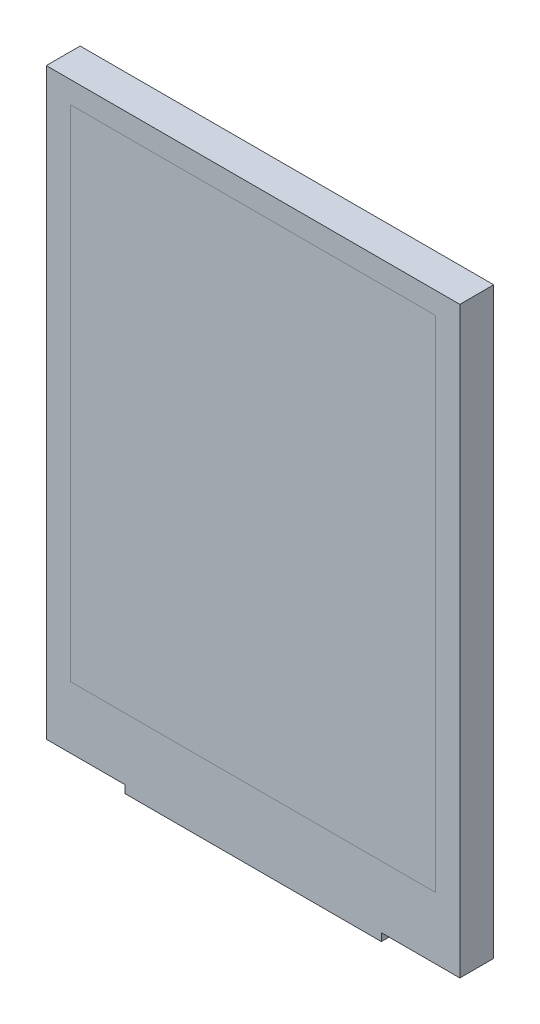
ISO-10303-21;
HEADER;
FILE_DESCRIPTION(('STEP AP214'),'2;1');
FILE_NAME('part.step','',(''),(''),'','','');
FILE_SCHEMA(('AUTOMOTIVE_DESIGN { 1 0 10303 214 1 1 1 1 }'));
ENDSEC;
DATA;
#1=APPLICATION_CONTEXT('core data for automotive mechanical design processes');
#2=APPLICATION_PROTOCOL_DEFINITION('international standard','automotive_design',2000,#1);
#3=PRODUCT_CONTEXT('',#1,'mechanical');
#4=PRODUCT('Part','Part','',(#3));
#5=PRODUCT_RELATED_PRODUCT_CATEGORY('part','',(#4));
#6=PRODUCT_DEFINITION_FORMATION('','',#4);
#7=PRODUCT_DEFINITION_CONTEXT('part definition',#1,'design');
#8=PRODUCT_DEFINITION('design','',#6,#7);
#9=PRODUCT_DEFINITION_SHAPE('','',#8);
#10=(LENGTH_UNIT() NAMED_UNIT(*) SI_UNIT(.MILLI.,.METRE.));
#11=(NAMED_UNIT(*) PLANE_ANGLE_UNIT() SI_UNIT($,.RADIAN.));
#12=(NAMED_UNIT(*) SI_UNIT($,.STERADIAN.) SOLID_ANGLE_UNIT());
#13=UNCERTAINTY_MEASURE_WITH_UNIT(LENGTH_MEASURE(1.E-05),#10,'distance_accuracy_value','');
#14=(GEOMETRIC_REPRESENTATION_CONTEXT(3) GLOBAL_UNCERTAINTY_ASSIGNED_CONTEXT((#13)) GLOBAL_UNIT_ASSIGNED_CONTEXT((#10,
#11,#12)) REPRESENTATION_CONTEXT('',''));
#15=CARTESIAN_POINT('',(0.,0.,0.));
#16=DIRECTION('',(0.,0.,1.));
#17=DIRECTION('',(1.,0.,0.));
#18=AXIS2_PLACEMENT_3D('',#15,#16,#17);
#19=CARTESIAN_POINT('',(0.,25.805,3.5));
#20=DIRECTION('',(0.,-1.,0.));
#21=DIRECTION('',(1.,0.,0.));
#22=AXIS2_PLACEMENT_3D('',#19,#20,#21);
#23=PLANE('',#22);
#24=DIRECTION('',(-1.,0.,0.));
#25=VECTOR('',#24,1.);
#26=CARTESIAN_POINT('',(0.,25.805,0.));
#27=LINE('',#26,#25);
#28=CARTESIAN_POINT('',(18.86,25.805,0.));
#29=VERTEX_POINT('',#28);
#30=CARTESIAN_POINT('',(-18.86,25.805,0.));
#31=VERTEX_POINT('',#30);
#32=EDGE_CURVE('E112',#29,#31,#27,.T.);
#33=ORIENTED_EDGE('',*,*,#32,.T.);
#34=DIRECTION('',(0.,0.,-1.));
#35=VECTOR('',#34,1.);
#36=CARTESIAN_POINT('',(-18.86,25.805,3.5));
#37=LINE('',#36,#35);
#38=CARTESIAN_POINT('',(-18.86,25.805,3.5));
#39=VERTEX_POINT('',#38);
#40=EDGE_CURVE('E12',#39,#31,#37,.T.);
#41=ORIENTED_EDGE('',*,*,#40,.F.);
#42=DIRECTION('',(-1.,0.,0.));
#43=VECTOR('',#42,1.);
#44=CARTESIAN_POINT('',(0.,25.805,3.5));
#45=LINE('',#44,#43);
#46=CARTESIAN_POINT('',(18.86,25.805,3.5));
#47=VERTEX_POINT('',#46);
#48=EDGE_CURVE('E98',#47,#39,#45,.T.);
#49=ORIENTED_EDGE('',*,*,#48,.F.);
#50=DIRECTION('',(0.,0.,-1.));
#51=VECTOR('',#50,1.);
#52=CARTESIAN_POINT('',(18.86,25.805,3.5));
#53=LINE('',#52,#51);
#54=EDGE_CURVE('E65',#47,#29,#53,.T.);
#55=ORIENTED_EDGE('',*,*,#54,.T.);
#56=EDGE_LOOP('',(#33,#41,#49,#55));
#57=FACE_BOUND('',#56,.T.);
#58=ADVANCED_FACE('F49',(#57),#23,.F.);
#59=CARTESIAN_POINT('',(-18.86,0.,3.5));
#60=DIRECTION('',(1.,0.,0.));
#61=DIRECTION('',(0.,0.,-1.));
#62=AXIS2_PLACEMENT_3D('',#59,#60,#61);
#63=PLANE('',#62);
#64=DIRECTION('',(0.,-1.,0.));
#65=VECTOR('',#64,1.);
#66=CARTESIAN_POINT('',(-18.86,0.,0.));
#67=LINE('',#66,#65);
#68=CARTESIAN_POINT('',(-18.86,-25.805,0.));
#69=VERTEX_POINT('',#68);
#70=EDGE_CURVE('E103',#31,#69,#67,.T.);
#71=ORIENTED_EDGE('',*,*,#70,.T.);
#72=DIRECTION('',(0.,0.,-1.));
#73=VECTOR('',#72,1.);
#74=CARTESIAN_POINT('',(-18.86,-25.805,3.5));
#75=LINE('',#74,#73);
#76=CARTESIAN_POINT('',(-18.86,-25.805,3.5));
#77=VERTEX_POINT('',#76);
#78=EDGE_CURVE('E57',#77,#69,#75,.T.);
#79=ORIENTED_EDGE('',*,*,#78,.F.);
#80=DIRECTION('',(0.,-1.,0.));
#81=VECTOR('',#80,1.);
#82=CARTESIAN_POINT('',(-18.86,0.,3.5));
#83=LINE('',#82,#81);
#84=EDGE_CURVE('E90',#39,#77,#83,.T.);
#85=ORIENTED_EDGE('',*,*,#84,.F.);
#86=ORIENTED_EDGE('',*,*,#40,.T.);
#87=EDGE_LOOP('',(#71,#79,#85,#86));
#88=FACE_BOUND('',#87,.T.);
#89=ADVANCED_FACE('F102',(#88),#63,.F.);
#90=CARTESIAN_POINT('',(0.,-25.805,3.5));
#91=DIRECTION('',(0.,-1.,0.));
#92=DIRECTION('',(1.,0.,0.));
#93=AXIS2_PLACEMENT_3D('',#90,#91,#92);
#94=PLANE('',#93);
#95=DIRECTION('',(-1.,0.,0.));
#96=VECTOR('',#95,1.);
#97=CARTESIAN_POINT('',(0.,-25.805,0.));
#98=LINE('',#97,#96);
#99=CARTESIAN_POINT('',(18.86,-25.805,0.));
#100=VERTEX_POINT('',#99);
#101=EDGE_CURVE('E115',#100,#69,#98,.T.);
#102=ORIENTED_EDGE('',*,*,#101,.F.);
#103=DIRECTION('',(0.,0.,-1.));
#104=VECTOR('',#103,1.);
#105=CARTESIAN_POINT('',(18.86,-25.805,3.5));
#106=LINE('',#105,#104);
#107=CARTESIAN_POINT('',(18.86,-25.805,3.5));
#108=VERTEX_POINT('',#107);
#109=EDGE_CURVE('E79',#108,#100,#106,.T.);
#110=ORIENTED_EDGE('',*,*,#109,.F.);
#111=DIRECTION('',(-1.,0.,0.));
#112=VECTOR('',#111,1.);
#113=CARTESIAN_POINT('',(0.,-25.805,3.5));
#114=LINE('',#113,#112);
#115=EDGE_CURVE('E97',#108,#77,#114,.T.);
#116=ORIENTED_EDGE('',*,*,#115,.T.);
#117=ORIENTED_EDGE('',*,*,#78,.T.);
#118=EDGE_LOOP('',(#102,#110,#116,#117));
#119=FACE_BOUND('',#118,.T.);
#120=ADVANCED_FACE('F106',(#119),#94,.T.);
#121=CARTESIAN_POINT('',(18.86,0.,3.5));
#122=DIRECTION('',(1.,0.,0.));
#123=DIRECTION('',(0.,0.,-1.));
#124=AXIS2_PLACEMENT_3D('',#121,#122,#123);
#125=PLANE('',#124);
#126=DIRECTION('',(0.,-1.,0.));
#127=VECTOR('',#126,1.);
#128=CARTESIAN_POINT('',(18.86,0.,0.));
#129=LINE('',#128,#127);
#130=EDGE_CURVE('E117',#29,#100,#129,.T.);
#131=ORIENTED_EDGE('',*,*,#130,.F.);
#132=ORIENTED_EDGE('',*,*,#54,.F.);
#133=DIRECTION('',(0.,-1.,0.));
#134=VECTOR('',#133,1.);
#135=CARTESIAN_POINT('',(18.86,0.,3.5));
#136=LINE('',#135,#134);
#137=EDGE_CURVE('E107',#47,#108,#136,.T.);
#138=ORIENTED_EDGE('',*,*,#137,.T.);
#139=ORIENTED_EDGE('',*,*,#109,.T.);
#140=EDGE_LOOP('',(#131,#132,#138,#139));
#141=FACE_BOUND('',#140,.T.);
#142=ADVANCED_FACE('F123',(#141),#125,.T.);
#143=CARTESIAN_POINT('',(0.,0.,3.5));
#144=DIRECTION('',(0.,0.,1.));
#145=DIRECTION('',(1.,0.,0.));
#146=AXIS2_PLACEMENT_3D('',#143,#144,#145);
#147=PLANE('',#146);
#148=ORIENTED_EDGE('',*,*,#48,.T.);
#149=ORIENTED_EDGE('',*,*,#84,.T.);
#150=ORIENTED_EDGE('',*,*,#115,.F.);
#151=ORIENTED_EDGE('',*,*,#137,.F.);
#152=EDGE_LOOP('',(#148,#149,#150,#151));
#153=FACE_BOUND('',#152,.T.);
#154=ADVANCED_FACE('F94',(#153),#147,.T.);
#155=CARTESIAN_POINT('',(0.,0.,0.));
#156=DIRECTION('',(0.,0.,1.));
#157=DIRECTION('',(1.,0.,0.));
#158=AXIS2_PLACEMENT_3D('',#155,#156,#157);
#159=PLANE('',#158);
#160=ORIENTED_EDGE('',*,*,#32,.F.);
#161=ORIENTED_EDGE('',*,*,#130,.T.);
#162=ORIENTED_EDGE('',*,*,#101,.T.);
#163=ORIENTED_EDGE('',*,*,#70,.F.);
#164=EDGE_LOOP('',(#160,#161,#162,#163));
#165=FACE_BOUND('',#164,.T.);
#166=ADVANCED_FACE('F122',(#165),#159,.F.);
#167=CLOSED_SHELL('',(#58,#89,#120,#142,#154,#166));
#168=MANIFOLD_SOLID_BREP('B2',#167);
#169=CARTESIAN_POINT('',(0.,28.055,3.5));
#170=DIRECTION('',(0.,-1.,0.));
#171=DIRECTION('',(0.,0.,-1.));
#172=AXIS2_PLACEMENT_3D('',#169,#170,#171);
#173=PLANE('',#172);
#174=DIRECTION('',(-1.,0.,0.));
#175=VECTOR('',#174,1.);
#176=CARTESIAN_POINT('',(0.,28.055,0.));
#177=LINE('',#176,#175);
#178=CARTESIAN_POINT('',(21.36,28.055,0.));
#179=VERTEX_POINT('',#178);
#180=CARTESIAN_POINT('',(-21.36,28.055,0.));
#181=VERTEX_POINT('',#180);
#182=EDGE_CURVE('E367',#179,#181,#177,.T.);
#183=ORIENTED_EDGE('',*,*,#182,.T.);
#184=DIRECTION('',(0.,0.,-1.));
#185=VECTOR('',#184,1.);
#186=CARTESIAN_POINT('',(-21.36,28.055,3.5));
#187=LINE('',#186,#185);
#188=CARTESIAN_POINT('',(-21.36,28.055,3.5));
#189=VERTEX_POINT('',#188);
#190=EDGE_CURVE('E47',#189,#181,#187,.T.);
#191=ORIENTED_EDGE('',*,*,#190,.F.);
#192=DIRECTION('',(-1.,0.,0.));
#193=VECTOR('',#192,1.);
#194=CARTESIAN_POINT('',(0.,28.055,3.5));
#195=LINE('',#194,#193);
#196=CARTESIAN_POINT('',(21.36,28.055,3.5));
#197=VERTEX_POINT('',#196);
#198=EDGE_CURVE('E310',#197,#189,#195,.T.);
#199=ORIENTED_EDGE('',*,*,#198,.F.);
#200=DIRECTION('',(0.,0.,-1.));
#201=VECTOR('',#200,1.);
#202=CARTESIAN_POINT('',(21.36,28.055,3.5));
#203=LINE('',#202,#201);
#204=EDGE_CURVE('E196',#197,#179,#203,.T.);
#205=ORIENTED_EDGE('',*,*,#204,.T.);
#206=EDGE_LOOP('',(#183,#191,#199,#205));
#207=FACE_BOUND('',#206,.T.);
#208=ADVANCED_FACE('F177',(#207),#173,.F.);
#209=CARTESIAN_POINT('',(-21.36,0.,3.5));
#210=DIRECTION('',(1.,0.,0.));
#211=DIRECTION('',(0.,1.,0.));
#212=AXIS2_PLACEMENT_3D('',#209,#210,#211);
#213=PLANE('',#212);
#214=DIRECTION('',(0.,-1.,0.));
#215=VECTOR('',#214,1.);
#216=CARTESIAN_POINT('',(-21.36,0.,0.));
#217=LINE('',#216,#215);
#218=CARTESIAN_POINT('',(-21.36,-32.205,0.));
#219=VERTEX_POINT('',#218);
#220=EDGE_CURVE('E369',#181,#219,#217,.T.);
#221=ORIENTED_EDGE('',*,*,#220,.T.);
#222=DIRECTION('',(0.,0.,-1.));
#223=VECTOR('',#222,1.);
#224=CARTESIAN_POINT('',(-21.36,-32.205,3.5));
#225=LINE('',#224,#223);
#226=CARTESIAN_POINT('',(-21.36,-32.205,3.5));
#227=VERTEX_POINT('',#226);
#228=EDGE_CURVE('E187',#227,#219,#225,.T.);
#229=ORIENTED_EDGE('',*,*,#228,.F.);
#230=DIRECTION('',(0.,-1.,0.));
#231=VECTOR('',#230,1.);
#232=CARTESIAN_POINT('',(-21.36,0.,3.5));
#233=LINE('',#232,#231);
#234=EDGE_CURVE('E306',#189,#227,#233,.T.);
#235=ORIENTED_EDGE('',*,*,#234,.F.);
#236=ORIENTED_EDGE('',*,*,#190,.T.);
#237=EDGE_LOOP('',(#221,#229,#235,#236));
#238=FACE_BOUND('',#237,.T.);
#239=ADVANCED_FACE('F387',(#238),#213,.F.);
#240=CARTESIAN_POINT('',(0.,-32.205,3.5));
#241=DIRECTION('',(0.,-1.,0.));
#242=DIRECTION('',(0.,0.,-1.));
#243=AXIS2_PLACEMENT_3D('',#240,#241,#242);
#244=PLANE('',#243);
#245=DIRECTION('',(-1.,0.,0.));
#246=VECTOR('',#245,1.);
#247=CARTESIAN_POINT('',(0.,-32.205,0.));
#248=LINE('',#247,#246);
#249=CARTESIAN_POINT('',(-13.25,-32.205,0.));
#250=VERTEX_POINT('',#249);
#251=EDGE_CURVE('E328',#250,#219,#248,.T.);
#252=ORIENTED_EDGE('',*,*,#251,.F.);
#253=DIRECTION('',(0.,0.,-1.));
#254=VECTOR('',#253,1.);
#255=CARTESIAN_POINT('',(-13.25,-32.205,3.5));
#256=LINE('',#255,#254);
#257=CARTESIAN_POINT('',(-13.25,-32.205,3.5));
#258=VERTEX_POINT('',#257);
#259=EDGE_CURVE('E337',#258,#250,#256,.T.);
#260=ORIENTED_EDGE('',*,*,#259,.F.);
#261=DIRECTION('',(-1.,0.,0.));
#262=VECTOR('',#261,1.);
#263=CARTESIAN_POINT('',(0.,-32.205,3.5));
#264=LINE('',#263,#262);
#265=EDGE_CURVE('E299',#258,#227,#264,.T.);
#266=ORIENTED_EDGE('',*,*,#265,.T.);
#267=ORIENTED_EDGE('',*,*,#228,.T.);
#268=EDGE_LOOP('',(#252,#260,#266,#267));
#269=FACE_BOUND('',#268,.T.);
#270=ADVANCED_FACE('F384',(#269),#244,.T.);
#271=CARTESIAN_POINT('',(-13.25,0.,3.5));
#272=DIRECTION('',(-1.,0.,0.));
#273=DIRECTION('',(0.,0.,1.));
#274=AXIS2_PLACEMENT_3D('',#271,#272,#273);
#275=PLANE('',#274);
#276=DIRECTION('',(0.,1.,0.));
#277=VECTOR('',#276,1.);
#278=CARTESIAN_POINT('',(-13.25,0.,0.));
#279=LINE('',#278,#277);
#280=CARTESIAN_POINT('',(-13.25,-33.005,0.));
#281=VERTEX_POINT('',#280);
#282=EDGE_CURVE('E373',#281,#250,#279,.T.);
#283=ORIENTED_EDGE('',*,*,#282,.F.);
#284=DIRECTION('',(0.,0.,-1.));
#285=VECTOR('',#284,1.);
#286=CARTESIAN_POINT('',(-13.25,-33.005,3.5));
#287=LINE('',#286,#285);
#288=CARTESIAN_POINT('',(-13.25,-33.005,3.5));
#289=VERTEX_POINT('',#288);
#290=EDGE_CURVE('E335',#289,#281,#287,.T.);
#291=ORIENTED_EDGE('',*,*,#290,.F.);
#292=DIRECTION('',(0.,1.,0.));
#293=VECTOR('',#292,1.);
#294=CARTESIAN_POINT('',(-13.25,0.,3.5));
#295=LINE('',#294,#293);
#296=EDGE_CURVE('E305',#289,#258,#295,.T.);
#297=ORIENTED_EDGE('',*,*,#296,.T.);
#298=ORIENTED_EDGE('',*,*,#259,.T.);
#299=EDGE_LOOP('',(#283,#291,#297,#298));
#300=FACE_BOUND('',#299,.T.);
#301=ADVANCED_FACE('F382',(#300),#275,.T.);
#302=CARTESIAN_POINT('',(0.,-33.005,3.5));
#303=DIRECTION('',(0.,-1.,0.));
#304=DIRECTION('',(0.,0.,-1.));
#305=AXIS2_PLACEMENT_3D('',#302,#303,#304);
#306=PLANE('',#305);
#307=DIRECTION('',(-1.,0.,0.));
#308=VECTOR('',#307,1.);
#309=CARTESIAN_POINT('',(0.,-33.005,0.));
#310=LINE('',#309,#308);
#311=CARTESIAN_POINT('',(13.25,-33.005,0.));
#312=VERTEX_POINT('',#311);
#313=EDGE_CURVE('E375',#312,#281,#310,.T.);
#314=ORIENTED_EDGE('',*,*,#313,.F.);
#315=DIRECTION('',(0.,0.,-1.));
#316=VECTOR('',#315,1.);
#317=CARTESIAN_POINT('',(13.25,-33.005,3.5));
#318=LINE('',#317,#316);
#319=CARTESIAN_POINT('',(13.25,-33.005,3.5));
#320=VERTEX_POINT('',#319);
#321=EDGE_CURVE('E294',#320,#312,#318,.T.);
#322=ORIENTED_EDGE('',*,*,#321,.F.);
#323=DIRECTION('',(-1.,0.,0.));
#324=VECTOR('',#323,1.);
#325=CARTESIAN_POINT('',(0.,-33.005,3.5));
#326=LINE('',#325,#324);
#327=EDGE_CURVE('E284',#320,#289,#326,.T.);
#328=ORIENTED_EDGE('',*,*,#327,.T.);
#329=ORIENTED_EDGE('',*,*,#290,.T.);
#330=EDGE_LOOP('',(#314,#322,#328,#329));
#331=FACE_BOUND('',#330,.T.);
#332=ADVANCED_FACE('F380',(#331),#306,.T.);
#333=CARTESIAN_POINT('',(13.25,0.,3.5));
#334=DIRECTION('',(-1.,0.,0.));
#335=DIRECTION('',(0.,0.,1.));
#336=AXIS2_PLACEMENT_3D('',#333,#334,#335);
#337=PLANE('',#336);
#338=DIRECTION('',(0.,1.,0.));
#339=VECTOR('',#338,1.);
#340=CARTESIAN_POINT('',(13.25,0.,0.));
#341=LINE('',#340,#339);
#342=CARTESIAN_POINT('',(13.25,-32.205,0.));
#343=VERTEX_POINT('',#342);
#344=EDGE_CURVE('E291',#312,#343,#341,.T.);
#345=ORIENTED_EDGE('',*,*,#344,.T.);
#346=DIRECTION('',(0.,0.,-1.));
#347=VECTOR('',#346,1.);
#348=CARTESIAN_POINT('',(13.25,-32.205,3.5));
#349=LINE('',#348,#347);
#350=CARTESIAN_POINT('',(13.25,-32.205,3.5));
#351=VERTEX_POINT('',#350);
#352=EDGE_CURVE('E288',#351,#343,#349,.T.);
#353=ORIENTED_EDGE('',*,*,#352,.F.);
#354=DIRECTION('',(0.,1.,0.));
#355=VECTOR('',#354,1.);
#356=CARTESIAN_POINT('',(13.25,0.,3.5));
#357=LINE('',#356,#355);
#358=EDGE_CURVE('E275',#320,#351,#357,.T.);
#359=ORIENTED_EDGE('',*,*,#358,.F.);
#360=ORIENTED_EDGE('',*,*,#321,.T.);
#361=EDGE_LOOP('',(#345,#353,#359,#360));
#362=FACE_BOUND('',#361,.T.);
#363=ADVANCED_FACE('F289',(#362),#337,.F.);
#364=CARTESIAN_POINT('',(21.36,-32.205,0.));
#365=VERTEX_POINT('',#364);
#366=EDGE_CURVE('E324',#365,#343,#248,.T.);
#367=ORIENTED_EDGE('',*,*,#366,.F.);
#368=DIRECTION('',(0.,0.,-1.));
#369=VECTOR('',#368,1.);
#370=CARTESIAN_POINT('',(21.36,-32.205,3.5));
#371=LINE('',#370,#369);
#372=CARTESIAN_POINT('',(21.36,-32.205,3.5));
#373=VERTEX_POINT('',#372);
#374=EDGE_CURVE('E234',#373,#365,#371,.T.);
#375=ORIENTED_EDGE('',*,*,#374,.F.);
#376=EDGE_CURVE('E281',#373,#351,#264,.T.);
#377=ORIENTED_EDGE('',*,*,#376,.T.);
#378=ORIENTED_EDGE('',*,*,#352,.T.);
#379=EDGE_LOOP('',(#367,#375,#377,#378));
#380=FACE_BOUND('',#379,.T.);
#381=ADVANCED_FACE('F296',(#380),#244,.T.);
#382=CARTESIAN_POINT('',(-18.86,0.,3.5));
#383=DIRECTION('',(1.,0.,0.));
#384=DIRECTION('',(0.,0.,-1.));
#385=AXIS2_PLACEMENT_3D('',#382,#383,#384);
#386=PLANE('',#385);
#387=DIRECTION('',(0.,-1.,0.));
#388=VECTOR('',#387,1.);
#389=CARTESIAN_POINT('',(-18.86,0.,0.));
#390=LINE('',#389,#388);
#391=CARTESIAN_POINT('',(-18.86,25.805,0.));
#392=VERTEX_POINT('',#391);
#393=CARTESIAN_POINT('',(-18.86,-25.805,0.));
#394=VERTEX_POINT('',#393);
#395=EDGE_CURVE('E354',#392,#394,#390,.T.);
#396=ORIENTED_EDGE('',*,*,#395,.F.);
#397=DIRECTION('',(0.,0.,-1.));
#398=VECTOR('',#397,1.);
#399=CARTESIAN_POINT('',(-18.86,25.805,3.5));
#400=LINE('',#399,#398);
#401=CARTESIAN_POINT('',(-18.86,25.805,3.5));
#402=VERTEX_POINT('',#401);
#403=EDGE_CURVE('E181',#402,#392,#400,.T.);
#404=ORIENTED_EDGE('',*,*,#403,.F.);
#405=DIRECTION('',(0.,-1.,0.));
#406=VECTOR('',#405,1.);
#407=CARTESIAN_POINT('',(-18.86,0.,3.5));
#408=LINE('',#407,#406);
#409=CARTESIAN_POINT('',(-18.86,-25.805,3.5));
#410=VERTEX_POINT('',#409);
#411=EDGE_CURVE('E321',#402,#410,#408,.T.);
#412=ORIENTED_EDGE('',*,*,#411,.T.);
#413=DIRECTION('',(0.,0.,-1.));
#414=VECTOR('',#413,1.);
#415=CARTESIAN_POINT('',(-18.86,-25.805,3.5));
#416=LINE('',#415,#414);
#417=EDGE_CURVE('E300',#410,#394,#416,.T.);
#418=ORIENTED_EDGE('',*,*,#417,.T.);
#419=EDGE_LOOP('',(#396,#404,#412,#418));
#420=FACE_BOUND('',#419,.T.);
#421=ADVANCED_FACE('F179',(#420),#386,.T.);
#422=CARTESIAN_POINT('',(0.,25.805,3.5));
#423=DIRECTION('',(0.,-1.,0.));
#424=DIRECTION('',(1.,0.,0.));
#425=AXIS2_PLACEMENT_3D('',#422,#423,#424);
#426=PLANE('',#425);
#427=DIRECTION('',(-1.,0.,0.));
#428=VECTOR('',#427,1.);
#429=CARTESIAN_POINT('',(0.,25.805,0.));
#430=LINE('',#429,#428);
#431=CARTESIAN_POINT('',(18.86,25.805,0.));
#432=VERTEX_POINT('',#431);
#433=EDGE_CURVE('E351',#432,#392,#430,.T.);
#434=ORIENTED_EDGE('',*,*,#433,.F.);
#435=DIRECTION('',(0.,0.,-1.));
#436=VECTOR('',#435,1.);
#437=CARTESIAN_POINT('',(18.86,25.805,3.5));
#438=LINE('',#437,#436);
#439=CARTESIAN_POINT('',(18.86,25.805,3.5));
#440=VERTEX_POINT('',#439);
#441=EDGE_CURVE('E343',#440,#432,#438,.T.);
#442=ORIENTED_EDGE('',*,*,#441,.F.);
#443=DIRECTION('',(-1.,0.,0.));
#444=VECTOR('',#443,1.);
#445=CARTESIAN_POINT('',(0.,25.805,3.5));
#446=LINE('',#445,#444);
#447=EDGE_CURVE('E318',#440,#402,#446,.T.);
#448=ORIENTED_EDGE('',*,*,#447,.T.);
#449=ORIENTED_EDGE('',*,*,#403,.T.);
#450=EDGE_LOOP('',(#434,#442,#448,#449));
#451=FACE_BOUND('',#450,.T.);
#452=ADVANCED_FACE('F349',(#451),#426,.T.);
#453=CARTESIAN_POINT('',(18.86,0.,3.5));
#454=DIRECTION('',(1.,0.,0.));
#455=DIRECTION('',(0.,0.,-1.));
#456=AXIS2_PLACEMENT_3D('',#453,#454,#455);
#457=PLANE('',#456);
#458=DIRECTION('',(0.,-1.,0.));
#459=VECTOR('',#458,1.);
#460=CARTESIAN_POINT('',(18.86,0.,0.));
#461=LINE('',#460,#459);
#462=CARTESIAN_POINT('',(18.86,-25.805,0.));
#463=VERTEX_POINT('',#462);
#464=EDGE_CURVE('E361',#432,#463,#461,.T.);
#465=ORIENTED_EDGE('',*,*,#464,.T.);
#466=DIRECTION('',(0.,0.,-1.));
#467=VECTOR('',#466,1.);
#468=CARTESIAN_POINT('',(18.86,-25.805,3.5));
#469=LINE('',#468,#467);
#470=CARTESIAN_POINT('',(18.86,-25.805,3.5));
#471=VERTEX_POINT('',#470);
#472=EDGE_CURVE('E341',#471,#463,#469,.T.);
#473=ORIENTED_EDGE('',*,*,#472,.F.);
#474=DIRECTION('',(0.,-1.,0.));
#475=VECTOR('',#474,1.);
#476=CARTESIAN_POINT('',(18.86,0.,3.5));
#477=LINE('',#476,#475);
#478=EDGE_CURVE('E316',#440,#471,#477,.T.);
#479=ORIENTED_EDGE('',*,*,#478,.F.);
#480=ORIENTED_EDGE('',*,*,#441,.T.);
#481=EDGE_LOOP('',(#465,#473,#479,#480));
#482=FACE_BOUND('',#481,.T.);
#483=ADVANCED_FACE('F400',(#482),#457,.F.);
#484=CARTESIAN_POINT('',(0.,-25.805,3.5));
#485=DIRECTION('',(0.,-1.,0.));
#486=DIRECTION('',(1.,0.,0.));
#487=AXIS2_PLACEMENT_3D('',#484,#485,#486);
#488=PLANE('',#487);
#489=DIRECTION('',(-1.,0.,0.));
#490=VECTOR('',#489,1.);
#491=CARTESIAN_POINT('',(0.,-25.805,0.));
#492=LINE('',#491,#490);
#493=EDGE_CURVE('E363',#463,#394,#492,.T.);
#494=ORIENTED_EDGE('',*,*,#493,.T.);
#495=ORIENTED_EDGE('',*,*,#417,.F.);
#496=DIRECTION('',(-1.,0.,0.));
#497=VECTOR('',#496,1.);
#498=CARTESIAN_POINT('',(0.,-25.805,3.5));
#499=LINE('',#498,#497);
#500=EDGE_CURVE('E312',#471,#410,#499,.T.);
#501=ORIENTED_EDGE('',*,*,#500,.F.);
#502=ORIENTED_EDGE('',*,*,#472,.T.);
#503=EDGE_LOOP('',(#494,#495,#501,#502));
#504=FACE_BOUND('',#503,.T.);
#505=ADVANCED_FACE('F396',(#504),#488,.F.);
#506=CARTESIAN_POINT('',(21.36,0.,3.5));
#507=DIRECTION('',(1.,0.,0.));
#508=DIRECTION('',(0.,1.,0.));
#509=AXIS2_PLACEMENT_3D('',#506,#507,#508);
#510=PLANE('',#509);
#511=DIRECTION('',(0.,-1.,0.));
#512=VECTOR('',#511,1.);
#513=CARTESIAN_POINT('',(21.36,0.,0.));
#514=LINE('',#513,#512);
#515=EDGE_CURVE('E322',#179,#365,#514,.T.);
#516=ORIENTED_EDGE('',*,*,#515,.F.);
#517=ORIENTED_EDGE('',*,*,#204,.F.);
#518=DIRECTION('',(0.,-1.,0.));
#519=VECTOR('',#518,1.);
#520=CARTESIAN_POINT('',(21.36,0.,3.5));
#521=LINE('',#520,#519);
#522=EDGE_CURVE('E297',#197,#373,#521,.T.);
#523=ORIENTED_EDGE('',*,*,#522,.T.);
#524=ORIENTED_EDGE('',*,*,#374,.T.);
#525=EDGE_LOOP('',(#516,#517,#523,#524));
#526=FACE_BOUND('',#525,.T.);
#527=ADVANCED_FACE('F399',(#526),#510,.T.);
#528=CARTESIAN_POINT('',(0.,0.,3.5));
#529=DIRECTION('',(0.,0.,1.));
#530=DIRECTION('',(1.,0.,0.));
#531=AXIS2_PLACEMENT_3D('',#528,#529,#530);
#532=PLANE('',#531);
#533=ORIENTED_EDGE('',*,*,#411,.F.);
#534=ORIENTED_EDGE('',*,*,#447,.F.);
#535=ORIENTED_EDGE('',*,*,#478,.T.);
#536=ORIENTED_EDGE('',*,*,#500,.T.);
#537=EDGE_LOOP('',(#533,#534,#535,#536));
#538=FACE_BOUND('',#537,.T.);
#539=ORIENTED_EDGE('',*,*,#198,.T.);
#540=ORIENTED_EDGE('',*,*,#234,.T.);
#541=ORIENTED_EDGE('',*,*,#265,.F.);
#542=ORIENTED_EDGE('',*,*,#296,.F.);
#543=ORIENTED_EDGE('',*,*,#327,.F.);
#544=ORIENTED_EDGE('',*,*,#358,.T.);
#545=ORIENTED_EDGE('',*,*,#376,.F.);
#546=ORIENTED_EDGE('',*,*,#522,.F.);
#547=EDGE_LOOP('',(#539,#540,#541,#542,#543,#544,#545,#546));
#548=FACE_BOUND('',#547,.T.);
#549=ADVANCED_FACE('F278',(#538,#548),#532,.T.);
#550=CARTESIAN_POINT('',(0.,0.,0.));
#551=DIRECTION('',(0.,0.,1.));
#552=DIRECTION('',(1.,0.,0.));
#553=AXIS2_PLACEMENT_3D('',#550,#551,#552);
#554=PLANE('',#553);
#555=ORIENTED_EDGE('',*,*,#395,.T.);
#556=ORIENTED_EDGE('',*,*,#493,.F.);
#557=ORIENTED_EDGE('',*,*,#464,.F.);
#558=ORIENTED_EDGE('',*,*,#433,.T.);
#559=EDGE_LOOP('',(#555,#556,#557,#558));
#560=FACE_BOUND('',#559,.T.);
#561=ORIENTED_EDGE('',*,*,#182,.F.);
#562=ORIENTED_EDGE('',*,*,#515,.T.);
#563=ORIENTED_EDGE('',*,*,#366,.T.);
#564=ORIENTED_EDGE('',*,*,#344,.F.);
#565=ORIENTED_EDGE('',*,*,#313,.T.);
#566=ORIENTED_EDGE('',*,*,#282,.T.);
#567=ORIENTED_EDGE('',*,*,#251,.T.);
#568=ORIENTED_EDGE('',*,*,#220,.F.);
#569=EDGE_LOOP('',(#561,#562,#563,#564,#565,#566,#567,#568));
#570=FACE_BOUND('',#569,.T.);
#571=ADVANCED_FACE('F360',(#560,#570),#554,.F.);
#572=CLOSED_SHELL('',(#208,#239,#270,#301,#332,#363,#381,#421,#452,#483,#505,#527,#549,#571));
#573=MANIFOLD_SOLID_BREP('B6',#572);
#574=ADVANCED_BREP_SHAPE_REPRESENTATION('',(#18,#168,#573),#14);
#575=SHAPE_DEFINITION_REPRESENTATION(#9,#574);
ENDSEC;
END-ISO-10303-21;
